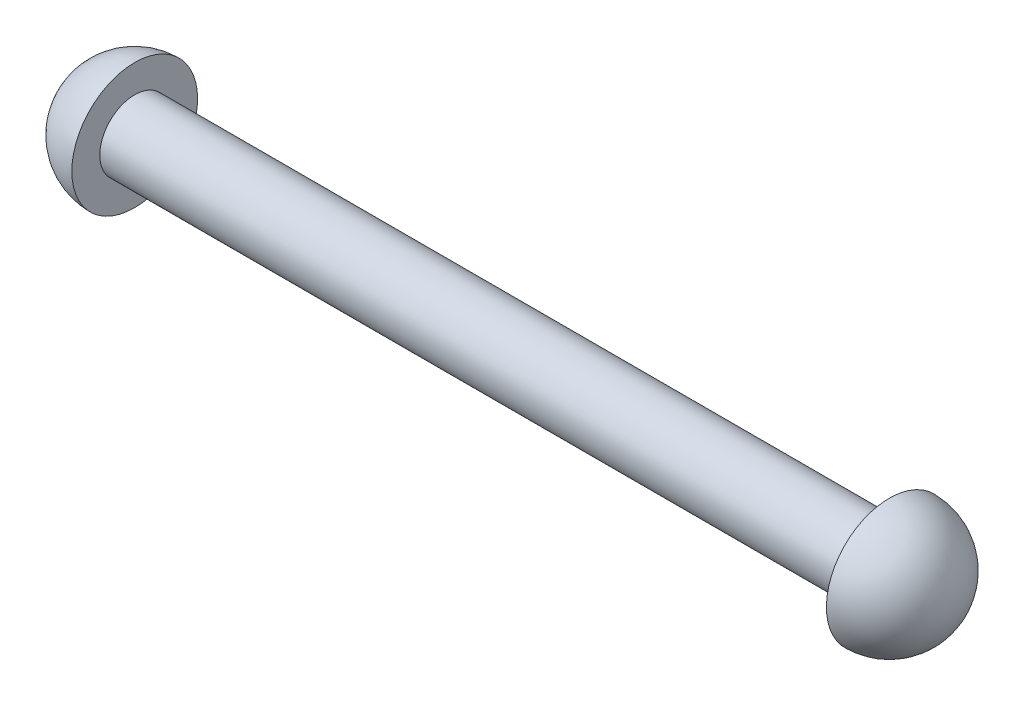
ISO-10303-21;
HEADER;
FILE_DESCRIPTION(('STEP AP214'),'2;1');
FILE_NAME('part.step','',(''),(''),'','','');
FILE_SCHEMA(('AUTOMOTIVE_DESIGN { 1 0 10303 214 1 1 1 1 }'));
ENDSEC;
DATA;
#1=APPLICATION_CONTEXT('core data for automotive mechanical design processes');
#2=APPLICATION_PROTOCOL_DEFINITION('international standard','automotive_design',2000,#1);
#3=PRODUCT_CONTEXT('',#1,'mechanical');
#4=PRODUCT('Part','Part','',(#3));
#5=PRODUCT_RELATED_PRODUCT_CATEGORY('part','',(#4));
#6=PRODUCT_DEFINITION_FORMATION('','',#4);
#7=PRODUCT_DEFINITION_CONTEXT('part definition',#1,'design');
#8=PRODUCT_DEFINITION('design','',#6,#7);
#9=PRODUCT_DEFINITION_SHAPE('','',#8);
#10=(LENGTH_UNIT() NAMED_UNIT(*) SI_UNIT(.MILLI.,.METRE.));
#11=(NAMED_UNIT(*) PLANE_ANGLE_UNIT() SI_UNIT($,.RADIAN.));
#12=(NAMED_UNIT(*) SI_UNIT($,.STERADIAN.) SOLID_ANGLE_UNIT());
#13=UNCERTAINTY_MEASURE_WITH_UNIT(LENGTH_MEASURE(1.E-05),#10,'distance_accuracy_value','');
#14=(GEOMETRIC_REPRESENTATION_CONTEXT(3) GLOBAL_UNCERTAINTY_ASSIGNED_CONTEXT((#13)) GLOBAL_UNIT_ASSIGNED_CONTEXT((#10,
#11,#12)) REPRESENTATION_CONTEXT('',''));
#15=CARTESIAN_POINT('',(0.,0.,0.));
#16=DIRECTION('',(0.,0.,1.));
#17=DIRECTION('',(1.,0.,0.));
#18=AXIS2_PLACEMENT_3D('',#15,#16,#17);
#19=CARTESIAN_POINT('',(5.715,0.,0.));
#20=DIRECTION('',(-1.,0.,0.));
#21=DIRECTION('',(0.,1.,0.));
#22=AXIS2_PLACEMENT_3D('',#19,#20,#21);
#23=SPHERICAL_SURFACE('',#22,5.715);
#24=CARTESIAN_POINT('',(5.715,0.,0.));
#25=DIRECTION('',(-1.,0.,0.));
#26=DIRECTION('',(0.,-1.,0.));
#27=AXIS2_PLACEMENT_3D('',#24,#25,#26);
#28=CIRCLE('',#27,5.715);
#29=CARTESIAN_POINT('',(5.715,-5.715,0.));
#30=VERTEX_POINT('',#29);
#31=EDGE_CURVE('E10',#30,#30,#28,.T.);
#32=ORIENTED_EDGE('',*,*,#31,.T.);
#33=EDGE_LOOP('',(#32));
#34=FACE_BOUND('',#33,.T.);
#35=ADVANCED_FACE('F43',(#34),#23,.T.);
#36=CARTESIAN_POINT('',(5.715,5.715,0.));
#37=DIRECTION('',(-1.,0.,0.));
#38=DIRECTION('',(0.,-1.,0.));
#39=AXIS2_PLACEMENT_3D('',#36,#37,#38);
#40=PLANE('',#39);
#41=ORIENTED_EDGE('',*,*,#31,.F.);
#42=EDGE_LOOP('',(#41));
#43=FACE_BOUND('',#42,.T.);
#44=CARTESIAN_POINT('',(5.715,0.,0.));
#45=DIRECTION('',(-1.,0.,0.));
#46=DIRECTION('',(0.,-1.,0.));
#47=AXIS2_PLACEMENT_3D('',#44,#45,#46);
#48=CIRCLE('',#47,3.175);
#49=CARTESIAN_POINT('',(5.715,-3.175,0.));
#50=VERTEX_POINT('',#49);
#51=EDGE_CURVE('E50',#50,#50,#48,.T.);
#52=ORIENTED_EDGE('',*,*,#51,.T.);
#53=EDGE_LOOP('',(#52));
#54=FACE_BOUND('',#53,.T.);
#55=ADVANCED_FACE('F79',(#43,#54),#40,.F.);
#56=CARTESIAN_POINT('',(0.,0.,0.));
#57=DIRECTION('',(-1.,0.,0.));
#58=DIRECTION('',(0.,-1.,0.));
#59=AXIS2_PLACEMENT_3D('',#56,#57,#58);
#60=CYLINDRICAL_SURFACE('',#59,3.175);
#61=ORIENTED_EDGE('',*,*,#51,.F.);
#62=EDGE_LOOP('',(#61));
#63=FACE_BOUND('',#62,.T.);
#64=CARTESIAN_POINT('',(74.295,0.,0.));
#65=DIRECTION('',(-1.,0.,0.));
#66=DIRECTION('',(0.,-1.,0.));
#67=AXIS2_PLACEMENT_3D('',#64,#65,#66);
#68=CIRCLE('',#67,3.175);
#69=CARTESIAN_POINT('',(74.295,-3.175,0.));
#70=VERTEX_POINT('',#69);
#71=EDGE_CURVE('E55',#70,#70,#68,.T.);
#72=ORIENTED_EDGE('',*,*,#71,.T.);
#73=EDGE_LOOP('',(#72));
#74=FACE_BOUND('',#73,.T.);
#75=ADVANCED_FACE('F75',(#63,#74),#60,.T.);
#76=CARTESIAN_POINT('',(74.295,5.715,0.));
#77=DIRECTION('',(1.,0.,0.));
#78=DIRECTION('',(0.,1.,0.));
#79=AXIS2_PLACEMENT_3D('',#76,#77,#78);
#80=PLANE('',#79);
#81=ORIENTED_EDGE('',*,*,#71,.F.);
#82=EDGE_LOOP('',(#81));
#83=FACE_BOUND('',#82,.T.);
#84=CARTESIAN_POINT('',(74.295,0.,0.));
#85=DIRECTION('',(-1.,0.,0.));
#86=DIRECTION('',(0.,-1.,0.));
#87=AXIS2_PLACEMENT_3D('',#84,#85,#86);
#88=CIRCLE('',#87,5.715);
#89=CARTESIAN_POINT('',(74.295,-5.715,0.));
#90=VERTEX_POINT('',#89);
#91=EDGE_CURVE('E60',#90,#90,#88,.T.);
#92=ORIENTED_EDGE('',*,*,#91,.T.);
#93=EDGE_LOOP('',(#92));
#94=FACE_BOUND('',#93,.T.);
#95=ADVANCED_FACE('F67',(#83,#94),#80,.F.);
#96=CARTESIAN_POINT('',(74.295,0.,0.));
#97=DIRECTION('',(-1.,0.,0.));
#98=DIRECTION('',(0.,-1.,0.));
#99=AXIS2_PLACEMENT_3D('',#96,#97,#98);
#100=SPHERICAL_SURFACE('',#99,5.715);
#101=ORIENTED_EDGE('',*,*,#91,.F.);
#102=EDGE_LOOP('',(#101));
#103=FACE_BOUND('',#102,.T.);
#104=ADVANCED_FACE('F69',(#103),#100,.T.);
#105=CLOSED_SHELL('',(#35,#55,#75,#95,#104));
#106=MANIFOLD_SOLID_BREP('B2',#105);
#107=ADVANCED_BREP_SHAPE_REPRESENTATION('',(#18,#106),#14);
#108=SHAPE_DEFINITION_REPRESENTATION(#9,#107);
ENDSEC;
END-ISO-10303-21;
